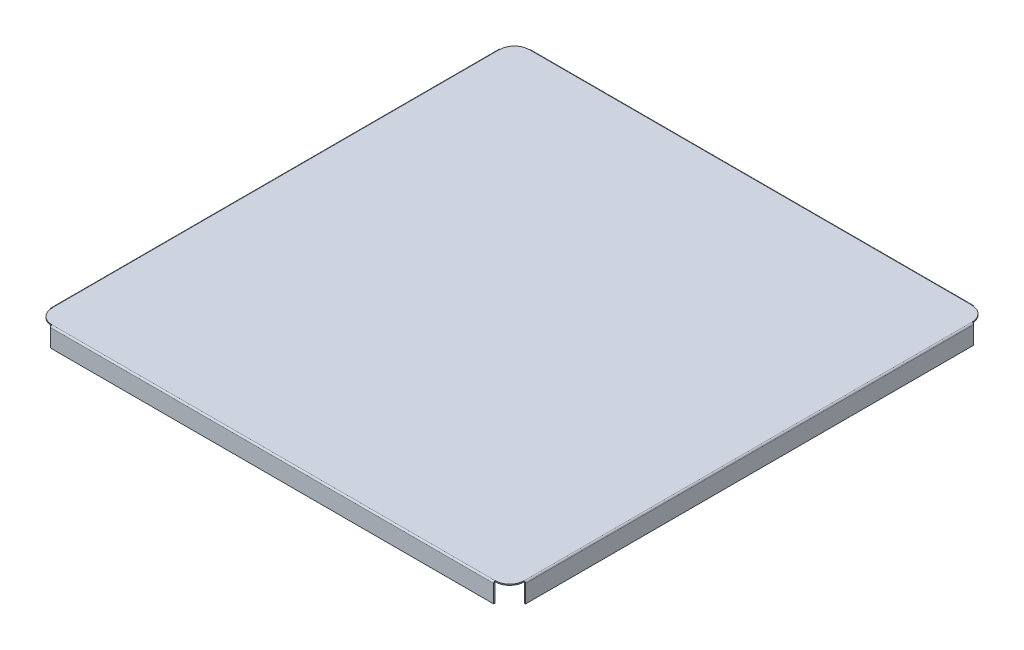
ISO-10303-21;
HEADER;
FILE_DESCRIPTION(('STEP AP214'),'2;1');
FILE_NAME('part.step','',(''),(''),'','','');
FILE_SCHEMA(('AUTOMOTIVE_DESIGN { 1 0 10303 214 1 1 1 1 }'));
ENDSEC;
DATA;
#1=APPLICATION_CONTEXT('core data for automotive mechanical design processes');
#2=APPLICATION_PROTOCOL_DEFINITION('international standard','automotive_design',2000,#1);
#3=PRODUCT_CONTEXT('',#1,'mechanical');
#4=PRODUCT('Part','Part','',(#3));
#5=PRODUCT_RELATED_PRODUCT_CATEGORY('part','',(#4));
#6=PRODUCT_DEFINITION_FORMATION('','',#4);
#7=PRODUCT_DEFINITION_CONTEXT('part definition',#1,'design');
#8=PRODUCT_DEFINITION('design','',#6,#7);
#9=PRODUCT_DEFINITION_SHAPE('','',#8);
#10=(LENGTH_UNIT() NAMED_UNIT(*) SI_UNIT(.MILLI.,.METRE.));
#11=(NAMED_UNIT(*) PLANE_ANGLE_UNIT() SI_UNIT($,.RADIAN.));
#12=(NAMED_UNIT(*) SI_UNIT($,.STERADIAN.) SOLID_ANGLE_UNIT());
#13=UNCERTAINTY_MEASURE_WITH_UNIT(LENGTH_MEASURE(1.E-05),#10,'distance_accuracy_value','');
#14=(GEOMETRIC_REPRESENTATION_CONTEXT(3) GLOBAL_UNCERTAINTY_ASSIGNED_CONTEXT((#13)) GLOBAL_UNIT_ASSIGNED_CONTEXT((#10,
#11,#12)) REPRESENTATION_CONTEXT('',''));
#15=CARTESIAN_POINT('',(0.,0.,0.));
#16=DIRECTION('',(0.,0.,1.));
#17=DIRECTION('',(1.,0.,0.));
#18=AXIS2_PLACEMENT_3D('',#15,#16,#17);
#19=CARTESIAN_POINT('',(-181.882415,0.035,-183.8189237));
#20=DIRECTION('',(0.,1.,0.));
#21=DIRECTION('',(0.,0.,1.));
#22=AXIS2_PLACEMENT_3D('',#19,#20,#21);
#23=CYLINDRICAL_SURFACE('',#22,11.811);
#24=DIRECTION('',(0.,1.,0.));
#25=VECTOR('',#24,1.);
#26=CARTESIAN_POINT('',(-181.882415,0.035,-195.6299237));
#27=LINE('',#26,#25);
#28=CARTESIAN_POINT('',(-181.882415,-0.854000000000024,-195.6299237));
#29=VERTEX_POINT('',#28);
#30=CARTESIAN_POINT('',(-181.882415,0.035,-195.6299237));
#31=VERTEX_POINT('',#30);
#32=EDGE_CURVE('E129',#29,#31,#27,.T.);
#33=ORIENTED_EDGE('',*,*,#32,.F.);
#34=CARTESIAN_POINT('',(-181.882415,-0.854,-183.8189237));
#35=DIRECTION('',(0.,1.,0.));
#36=DIRECTION('',(0.,0.,1.));
#37=AXIS2_PLACEMENT_3D('',#34,#35,#36);
#38=CIRCLE('',#37,11.811);
#39=CARTESIAN_POINT('',(-193.693415,-0.854000000000023,-183.8189237));
#40=VERTEX_POINT('',#39);
#41=EDGE_CURVE('E254',#29,#40,#38,.T.);
#42=ORIENTED_EDGE('',*,*,#41,.T.);
#43=DIRECTION('',(0.,1.,0.));
#44=VECTOR('',#43,1.);
#45=CARTESIAN_POINT('',(-193.693415,0.035,-183.8189237));
#46=LINE('',#45,#44);
#47=CARTESIAN_POINT('',(-193.693415,0.0349999999999771,-183.8189237));
#48=VERTEX_POINT('',#47);
#49=EDGE_CURVE('E223',#40,#48,#46,.T.);
#50=ORIENTED_EDGE('',*,*,#49,.T.);
#51=CARTESIAN_POINT('',(-181.882415,0.035,-183.8189237));
#52=DIRECTION('',(0.,1.,0.));
#53=DIRECTION('',(0.,0.,1.));
#54=AXIS2_PLACEMENT_3D('',#51,#52,#53);
#55=CIRCLE('',#54,11.811);
#56=EDGE_CURVE('E228',#31,#48,#55,.T.);
#57=ORIENTED_EDGE('',*,*,#56,.F.);
#58=EDGE_LOOP('',(#33,#42,#50,#57));
#59=FACE_BOUND('',#58,.T.);
#60=ADVANCED_FACE('F119',(#59),#23,.T.);
#61=CARTESIAN_POINT('',(-181.882415,0.035,183.8189237));
#62=DIRECTION('',(0.,1.,0.));
#63=DIRECTION('',(0.,0.,1.));
#64=AXIS2_PLACEMENT_3D('',#61,#62,#63);
#65=CYLINDRICAL_SURFACE('',#64,11.811);
#66=DIRECTION('',(0.,1.,0.));
#67=VECTOR('',#66,1.);
#68=CARTESIAN_POINT('',(-193.693415,0.035,183.8189237));
#69=LINE('',#68,#67);
#70=CARTESIAN_POINT('',(-193.693415,-0.854000000000023,183.8189237));
#71=VERTEX_POINT('',#70);
#72=CARTESIAN_POINT('',(-193.693415,0.035,183.8189237));
#73=VERTEX_POINT('',#72);
#74=EDGE_CURVE('E269',#71,#73,#69,.T.);
#75=ORIENTED_EDGE('',*,*,#74,.F.);
#76=CARTESIAN_POINT('',(-181.882415,-0.854,183.8189237));
#77=DIRECTION('',(0.,1.,0.));
#78=DIRECTION('',(0.,0.,1.));
#79=AXIS2_PLACEMENT_3D('',#76,#77,#78);
#80=CIRCLE('',#79,11.811);
#81=CARTESIAN_POINT('',(-181.882415,-0.854,195.6299237));
#82=VERTEX_POINT('',#81);
#83=EDGE_CURVE('E250',#71,#82,#80,.T.);
#84=ORIENTED_EDGE('',*,*,#83,.T.);
#85=DIRECTION('',(0.,1.,0.));
#86=VECTOR('',#85,1.);
#87=CARTESIAN_POINT('',(-181.882415,0.035,195.6299237));
#88=LINE('',#87,#86);
#89=CARTESIAN_POINT('',(-181.882415,0.0349999999999786,195.6299237));
#90=VERTEX_POINT('',#89);
#91=EDGE_CURVE('E266',#82,#90,#88,.T.);
#92=ORIENTED_EDGE('',*,*,#91,.T.);
#93=CARTESIAN_POINT('',(-181.882415,0.035,183.8189237));
#94=DIRECTION('',(0.,1.,0.));
#95=DIRECTION('',(0.,0.,1.));
#96=AXIS2_PLACEMENT_3D('',#93,#94,#95);
#97=CIRCLE('',#96,11.811);
#98=EDGE_CURVE('E233',#73,#90,#97,.T.);
#99=ORIENTED_EDGE('',*,*,#98,.F.);
#100=EDGE_LOOP('',(#75,#84,#92,#99));
#101=FACE_BOUND('',#100,.T.);
#102=ADVANCED_FACE('F283',(#101),#65,.T.);
#103=CARTESIAN_POINT('',(181.882415,0.035,183.8189237));
#104=DIRECTION('',(0.,1.,0.));
#105=DIRECTION('',(0.,0.,1.));
#106=AXIS2_PLACEMENT_3D('',#103,#104,#105);
#107=CYLINDRICAL_SURFACE('',#106,11.811);
#108=DIRECTION('',(0.,1.,0.));
#109=VECTOR('',#108,1.);
#110=CARTESIAN_POINT('',(181.882415,0.035,195.6299237));
#111=LINE('',#110,#109);
#112=CARTESIAN_POINT('',(181.882415,-0.854,195.6299237));
#113=VERTEX_POINT('',#112);
#114=CARTESIAN_POINT('',(181.882415,0.035,195.6299237));
#115=VERTEX_POINT('',#114);
#116=EDGE_CURVE('E263',#113,#115,#111,.T.);
#117=ORIENTED_EDGE('',*,*,#116,.F.);
#118=CARTESIAN_POINT('',(181.882415,-0.854,183.8189237));
#119=DIRECTION('',(0.,1.,0.));
#120=DIRECTION('',(0.,0.,1.));
#121=AXIS2_PLACEMENT_3D('',#118,#119,#120);
#122=CIRCLE('',#121,11.811);
#123=CARTESIAN_POINT('',(193.693415,-0.854,183.8189237));
#124=VERTEX_POINT('',#123);
#125=EDGE_CURVE('E245',#113,#124,#122,.T.);
#126=ORIENTED_EDGE('',*,*,#125,.T.);
#127=DIRECTION('',(0.,1.,0.));
#128=VECTOR('',#127,1.);
#129=CARTESIAN_POINT('',(193.693415,0.035,183.8189237));
#130=LINE('',#129,#128);
#131=CARTESIAN_POINT('',(193.693415,0.0350000000000435,183.8189237));
#132=VERTEX_POINT('',#131);
#133=EDGE_CURVE('E260',#124,#132,#130,.T.);
#134=ORIENTED_EDGE('',*,*,#133,.T.);
#135=CARTESIAN_POINT('',(181.882415,0.035,183.8189237));
#136=DIRECTION('',(0.,1.,0.));
#137=DIRECTION('',(0.,0.,1.));
#138=AXIS2_PLACEMENT_3D('',#135,#136,#137);
#139=CIRCLE('',#138,11.811);
#140=EDGE_CURVE('E239',#115,#132,#139,.T.);
#141=ORIENTED_EDGE('',*,*,#140,.F.);
#142=EDGE_LOOP('',(#117,#126,#134,#141));
#143=FACE_BOUND('',#142,.T.);
#144=ADVANCED_FACE('F501',(#143),#107,.T.);
#145=CARTESIAN_POINT('',(181.882415,0.035,-183.8189237));
#146=DIRECTION('',(0.,1.,0.));
#147=DIRECTION('',(0.,0.,1.));
#148=AXIS2_PLACEMENT_3D('',#145,#146,#147);
#149=CYLINDRICAL_SURFACE('',#148,11.811);
#150=CARTESIAN_POINT('',(181.882415,-0.854,-183.8189237));
#151=DIRECTION('',(0.,1.,0.));
#152=DIRECTION('',(0.,0.,1.));
#153=AXIS2_PLACEMENT_3D('',#150,#151,#152);
#154=CIRCLE('',#153,11.811);
#155=CARTESIAN_POINT('',(193.693415,-0.854,-183.8189237));
#156=VERTEX_POINT('',#155);
#157=CARTESIAN_POINT('',(181.882415,-0.854000000000024,-195.6299237));
#158=VERTEX_POINT('',#157);
#159=EDGE_CURVE('E243',#156,#158,#154,.T.);
#160=ORIENTED_EDGE('',*,*,#159,.T.);
#161=DIRECTION('',(0.,1.,0.));
#162=VECTOR('',#161,1.);
#163=CARTESIAN_POINT('',(181.882415,0.035,-195.6299237));
#164=LINE('',#163,#162);
#165=CARTESIAN_POINT('',(181.882415,0.034999999999976,-195.6299237));
#166=VERTEX_POINT('',#165);
#167=EDGE_CURVE('E13',#158,#166,#164,.T.);
#168=ORIENTED_EDGE('',*,*,#167,.T.);
#169=CARTESIAN_POINT('',(181.882415,0.035,-183.8189237));
#170=DIRECTION('',(0.,1.,0.));
#171=DIRECTION('',(0.,0.,1.));
#172=AXIS2_PLACEMENT_3D('',#169,#170,#171);
#173=CIRCLE('',#172,11.811);
#174=CARTESIAN_POINT('',(193.693415,0.035,-183.8189237));
#175=VERTEX_POINT('',#174);
#176=EDGE_CURVE('E229',#175,#166,#173,.T.);
#177=ORIENTED_EDGE('',*,*,#176,.F.);
#178=DIRECTION('',(0.,1.,0.));
#179=VECTOR('',#178,1.);
#180=CARTESIAN_POINT('',(193.693415,0.035,-183.8189237));
#181=LINE('',#180,#179);
#182=EDGE_CURVE('E123',#156,#175,#181,.T.);
#183=ORIENTED_EDGE('',*,*,#182,.F.);
#184=EDGE_LOOP('',(#160,#168,#177,#183));
#185=FACE_BOUND('',#184,.T.);
#186=ADVANCED_FACE('F121',(#185),#149,.T.);
#187=CARTESIAN_POINT('',(0.,0.035,0.));
#188=DIRECTION('',(0.,1.,0.));
#189=DIRECTION('',(0.,0.,1.));
#190=AXIS2_PLACEMENT_3D('',#187,#188,#189);
#191=PLANE('',#190);
#192=DIRECTION('',(0.,0.,1.));
#193=VECTOR('',#192,1.);
#194=CARTESIAN_POINT('',(193.693415,0.035,-195.6299237));
#195=LINE('',#194,#193);
#196=EDGE_CURVE('E248',#175,#132,#195,.T.);
#197=ORIENTED_EDGE('',*,*,#196,.F.);
#198=ORIENTED_EDGE('',*,*,#176,.T.);
#199=DIRECTION('',(-1.,0.,0.));
#200=VECTOR('',#199,1.);
#201=CARTESIAN_POINT('',(193.693415,0.035,-195.6299237));
#202=LINE('',#201,#200);
#203=EDGE_CURVE('E202',#166,#31,#202,.T.);
#204=ORIENTED_EDGE('',*,*,#203,.T.);
#205=ORIENTED_EDGE('',*,*,#56,.T.);
#206=DIRECTION('',(0.,0.,1.));
#207=VECTOR('',#206,1.);
#208=CARTESIAN_POINT('',(-193.693415,0.035,-195.6299237));
#209=LINE('',#208,#207);
#210=EDGE_CURVE('E171',#48,#73,#209,.T.);
#211=ORIENTED_EDGE('',*,*,#210,.T.);
#212=ORIENTED_EDGE('',*,*,#98,.T.);
#213=DIRECTION('',(-1.,0.,0.));
#214=VECTOR('',#213,1.);
#215=CARTESIAN_POINT('',(193.693415,0.035,195.6299237));
#216=LINE('',#215,#214);
#217=EDGE_CURVE('E137',#115,#90,#216,.T.);
#218=ORIENTED_EDGE('',*,*,#217,.F.);
#219=ORIENTED_EDGE('',*,*,#140,.T.);
#220=EDGE_LOOP('',(#197,#198,#204,#205,#211,#212,#218,#219));
#221=FACE_BOUND('',#220,.T.);
#222=ADVANCED_FACE('F227',(#221),#191,.T.);
#223=CARTESIAN_POINT('',(0.,-0.854,0.));
#224=DIRECTION('',(0.,1.,0.));
#225=DIRECTION('',(0.,0.,1.));
#226=AXIS2_PLACEMENT_3D('',#223,#224,#225);
#227=PLANE('',#226);
#228=DIRECTION('',(0.,0.,1.));
#229=VECTOR('',#228,1.);
#230=CARTESIAN_POINT('',(193.693415,-0.854,0.));
#231=LINE('',#230,#229);
#232=EDGE_CURVE('E241',#156,#124,#231,.T.);
#233=ORIENTED_EDGE('',*,*,#232,.T.);
#234=ORIENTED_EDGE('',*,*,#125,.F.);
#235=DIRECTION('',(1.,0.,0.));
#236=VECTOR('',#235,1.);
#237=CARTESIAN_POINT('',(0.,-0.854,195.6299237));
#238=LINE('',#237,#236);
#239=EDGE_CURVE('E156',#113,#82,#238,.F.);
#240=ORIENTED_EDGE('',*,*,#239,.T.);
#241=ORIENTED_EDGE('',*,*,#83,.F.);
#242=DIRECTION('',(0.,0.,1.));
#243=VECTOR('',#242,1.);
#244=CARTESIAN_POINT('',(-193.693415,-0.854,0.));
#245=LINE('',#244,#243);
#246=EDGE_CURVE('E252',#40,#71,#245,.T.);
#247=ORIENTED_EDGE('',*,*,#246,.F.);
#248=ORIENTED_EDGE('',*,*,#41,.F.);
#249=DIRECTION('',(1.,0.,0.));
#250=VECTOR('',#249,1.);
#251=CARTESIAN_POINT('',(0.,-0.854,-195.6299237));
#252=LINE('',#251,#250);
#253=EDGE_CURVE('E256',#158,#29,#252,.F.);
#254=ORIENTED_EDGE('',*,*,#253,.F.);
#255=ORIENTED_EDGE('',*,*,#159,.F.);
#256=EDGE_LOOP('',(#233,#234,#240,#241,#247,#248,#254,#255));
#257=FACE_BOUND('',#256,.T.);
#258=ADVANCED_FACE('F507',(#257),#227,.F.);
#259=CARTESIAN_POINT('',(-193.693415,-1.23499999999999,183.8189237));
#260=DIRECTION('',(0.,0.,1.));
#261=DIRECTION('',(1.,0.,0.));
#262=AXIS2_PLACEMENT_3D('',#259,#260,#261);
#263=PLANE('',#262);
#264=DIRECTION('',(-1.,0.,0.));
#265=VECTOR('',#264,1.);
#266=CARTESIAN_POINT('',(-194.963415,-1.23499999999998,183.8189237));
#267=LINE('',#266,#265);
#268=CARTESIAN_POINT('',(-194.074415,-1.23499999999999,183.8189237));
#269=VERTEX_POINT('',#268);
#270=CARTESIAN_POINT('',(-194.963415,-1.23499999999998,183.8189237));
#271=VERTEX_POINT('',#270);
#272=EDGE_CURVE('E308',#269,#271,#267,.T.);
#273=ORIENTED_EDGE('',*,*,#272,.F.);
#274=CARTESIAN_POINT('',(-193.693415,-1.23499999999999,183.8189237));
#275=DIRECTION('',(0.,0.,-1.));
#276=DIRECTION('',(-1.,0.,0.));
#277=AXIS2_PLACEMENT_3D('',#274,#275,#276);
#278=CIRCLE('',#277,0.380999999999965);
#279=EDGE_CURVE('E279',#71,#269,#278,.F.);
#280=ORIENTED_EDGE('',*,*,#279,.F.);
#281=ORIENTED_EDGE('',*,*,#74,.T.);
#282=CARTESIAN_POINT('',(-193.693415,-1.23499999999999,183.8189237));
#283=DIRECTION('',(0.,0.,-1.));
#284=DIRECTION('',(-1.,0.,0.));
#285=AXIS2_PLACEMENT_3D('',#282,#283,#284);
#286=CIRCLE('',#285,1.26999999999996);
#287=EDGE_CURVE('E244',#73,#271,#286,.F.);
#288=ORIENTED_EDGE('',*,*,#287,.T.);
#289=EDGE_LOOP('',(#273,#280,#281,#288));
#290=FACE_BOUND('',#289,.T.);
#291=ADVANCED_FACE('F276',(#290),#263,.T.);
#292=CARTESIAN_POINT('',(-193.693415,-1.23499999999999,-183.8189237));
#293=DIRECTION('',(0.,0.,1.));
#294=DIRECTION('',(1.,0.,0.));
#295=AXIS2_PLACEMENT_3D('',#292,#293,#294);
#296=PLANE('',#295);
#297=CARTESIAN_POINT('',(-193.693415,-1.23499999999999,-183.8189237));
#298=DIRECTION('',(0.,0.,-1.));
#299=DIRECTION('',(-1.,0.,0.));
#300=AXIS2_PLACEMENT_3D('',#297,#298,#299);
#301=CIRCLE('',#300,0.380999999999965);
#302=CARTESIAN_POINT('',(-194.074415,-1.23499999999999,-183.8189237));
#303=VERTEX_POINT('',#302);
#304=EDGE_CURVE('E320',#303,#40,#301,.T.);
#305=ORIENTED_EDGE('',*,*,#304,.F.);
#306=DIRECTION('',(-1.,0.,0.));
#307=VECTOR('',#306,1.);
#308=CARTESIAN_POINT('',(-194.074415,-1.23499999999999,-183.8189237));
#309=LINE('',#308,#307);
#310=CARTESIAN_POINT('',(-194.963415,-1.23499999999998,-183.8189237));
#311=VERTEX_POINT('',#310);
#312=EDGE_CURVE('E345',#303,#311,#309,.T.);
#313=ORIENTED_EDGE('',*,*,#312,.T.);
#314=CARTESIAN_POINT('',(-193.693415,-1.23499999999999,-183.8189237));
#315=DIRECTION('',(0.,0.,-1.));
#316=DIRECTION('',(-1.,0.,0.));
#317=AXIS2_PLACEMENT_3D('',#314,#315,#316);
#318=CIRCLE('',#317,1.26999999999996);
#319=EDGE_CURVE('E352',#311,#48,#318,.T.);
#320=ORIENTED_EDGE('',*,*,#319,.T.);
#321=ORIENTED_EDGE('',*,*,#49,.F.);
#322=EDGE_LOOP('',(#305,#313,#320,#321));
#323=FACE_BOUND('',#322,.T.);
#324=ADVANCED_FACE('F482',(#323),#296,.F.);
#325=CARTESIAN_POINT('',(-193.693415,-1.23499999999999,-183.8189237));
#326=DIRECTION('',(0.,0.,-1.));
#327=DIRECTION('',(-1.,0.,0.));
#328=AXIS2_PLACEMENT_3D('',#325,#326,#327);
#329=CYLINDRICAL_SURFACE('',#328,1.26999999999996);
#330=ORIENTED_EDGE('',*,*,#210,.F.);
#331=ORIENTED_EDGE('',*,*,#319,.F.);
#332=DIRECTION('',(0.,0.,-1.));
#333=VECTOR('',#332,1.);
#334=CARTESIAN_POINT('',(-194.963415,-1.23499999999998,0.));
#335=LINE('',#334,#333);
#336=EDGE_CURVE('E342',#271,#311,#335,.T.);
#337=ORIENTED_EDGE('',*,*,#336,.F.);
#338=ORIENTED_EDGE('',*,*,#287,.F.);
#339=EDGE_LOOP('',(#330,#331,#337,#338));
#340=FACE_BOUND('',#339,.T.);
#341=ADVANCED_FACE('F485',(#340),#329,.T.);
#342=CARTESIAN_POINT('',(-193.693415,-1.23499999999999,-183.8189237));
#343=DIRECTION('',(0.,0.,-1.));
#344=DIRECTION('',(-1.,0.,0.));
#345=AXIS2_PLACEMENT_3D('',#342,#343,#344);
#346=CYLINDRICAL_SURFACE('',#345,0.380999999999965);
#347=ORIENTED_EDGE('',*,*,#246,.T.);
#348=ORIENTED_EDGE('',*,*,#279,.T.);
#349=DIRECTION('',(0.,0.,1.));
#350=VECTOR('',#349,1.);
#351=CARTESIAN_POINT('',(-194.074415,-1.23499999999999,183.8189237));
#352=LINE('',#351,#350);
#353=EDGE_CURVE('E348',#269,#303,#352,.F.);
#354=ORIENTED_EDGE('',*,*,#353,.T.);
#355=ORIENTED_EDGE('',*,*,#304,.T.);
#356=EDGE_LOOP('',(#347,#348,#354,#355));
#357=FACE_BOUND('',#356,.T.);
#358=ADVANCED_FACE('F487',(#357),#346,.F.);
#359=CARTESIAN_POINT('',(-194.963415,-0.853999999999997,-183.8189237));
#360=DIRECTION('',(0.,0.,-1.));
#361=DIRECTION('',(-1.,0.,0.));
#362=AXIS2_PLACEMENT_3D('',#359,#360,#361);
#363=PLANE('',#362);
#364=DIRECTION('',(0.,1.,0.));
#365=VECTOR('',#364,1.);
#366=CARTESIAN_POINT('',(-194.963415,-0.853999999999997,-183.8189237));
#367=LINE('',#366,#365);
#368=CARTESIAN_POINT('',(-194.963415,-15.854,-183.8189237));
#369=VERTEX_POINT('',#368);
#370=EDGE_CURVE('E324',#369,#311,#367,.T.);
#371=ORIENTED_EDGE('',*,*,#370,.T.);
#372=ORIENTED_EDGE('',*,*,#312,.F.);
#373=DIRECTION('',(0.,-1.,0.));
#374=VECTOR('',#373,1.);
#375=CARTESIAN_POINT('',(-194.074415,7.16809630170919E-13,-183.8189237));
#376=LINE('',#375,#374);
#377=CARTESIAN_POINT('',(-194.074415,-15.854,-183.8189237));
#378=VERTEX_POINT('',#377);
#379=EDGE_CURVE('E333',#378,#303,#376,.F.);
#380=ORIENTED_EDGE('',*,*,#379,.F.);
#381=DIRECTION('',(1.,0.,0.));
#382=VECTOR('',#381,1.);
#383=CARTESIAN_POINT('',(-194.963415,-15.854,-183.8189237));
#384=LINE('',#383,#382);
#385=EDGE_CURVE('E317',#369,#378,#384,.T.);
#386=ORIENTED_EDGE('',*,*,#385,.F.);
#387=EDGE_LOOP('',(#371,#372,#380,#386));
#388=FACE_BOUND('',#387,.T.);
#389=ADVANCED_FACE('F478',(#388),#363,.T.);
#390=CARTESIAN_POINT('',(-194.963415,-15.854,183.8189237));
#391=DIRECTION('',(0.,0.,1.));
#392=DIRECTION('',(1.,0.,0.));
#393=AXIS2_PLACEMENT_3D('',#390,#391,#392);
#394=PLANE('',#393);
#395=DIRECTION('',(0.,1.,0.));
#396=VECTOR('',#395,1.);
#397=CARTESIAN_POINT('',(-194.074415,7.16809630170919E-13,183.8189237));
#398=LINE('',#397,#396);
#399=CARTESIAN_POINT('',(-194.074415,-15.854,183.8189237));
#400=VERTEX_POINT('',#399);
#401=EDGE_CURVE('E339',#269,#400,#398,.F.);
#402=ORIENTED_EDGE('',*,*,#401,.F.);
#403=ORIENTED_EDGE('',*,*,#272,.T.);
#404=DIRECTION('',(0.,-1.,0.));
#405=VECTOR('',#404,1.);
#406=CARTESIAN_POINT('',(-194.963415,-15.854,183.8189237));
#407=LINE('',#406,#405);
#408=CARTESIAN_POINT('',(-194.963415,-15.854,183.8189237));
#409=VERTEX_POINT('',#408);
#410=EDGE_CURVE('E330',#271,#409,#407,.T.);
#411=ORIENTED_EDGE('',*,*,#410,.T.);
#412=DIRECTION('',(1.,0.,0.));
#413=VECTOR('',#412,1.);
#414=CARTESIAN_POINT('',(-194.963415,-15.854,183.8189237));
#415=LINE('',#414,#413);
#416=EDGE_CURVE('E321',#409,#400,#415,.T.);
#417=ORIENTED_EDGE('',*,*,#416,.T.);
#418=EDGE_LOOP('',(#402,#403,#411,#417));
#419=FACE_BOUND('',#418,.T.);
#420=ADVANCED_FACE('F471',(#419),#394,.T.);
#421=CARTESIAN_POINT('',(-194.963415,7.1991355708115E-13,0.));
#422=DIRECTION('',(-1.,0.,0.));
#423=DIRECTION('',(0.,-1.,0.));
#424=AXIS2_PLACEMENT_3D('',#421,#422,#423);
#425=PLANE('',#424);
#426=ORIENTED_EDGE('',*,*,#410,.F.);
#427=ORIENTED_EDGE('',*,*,#336,.T.);
#428=ORIENTED_EDGE('',*,*,#370,.F.);
#429=DIRECTION('',(0.,0.,-1.));
#430=VECTOR('',#429,1.);
#431=CARTESIAN_POINT('',(-194.963415,-15.854,-183.8189237));
#432=LINE('',#431,#430);
#433=EDGE_CURVE('E327',#409,#369,#432,.T.);
#434=ORIENTED_EDGE('',*,*,#433,.F.);
#435=EDGE_LOOP('',(#426,#427,#428,#434));
#436=FACE_BOUND('',#435,.T.);
#437=ADVANCED_FACE('F484',(#436),#425,.T.);
#438=CARTESIAN_POINT('',(-194.074415,7.16809630170919E-13,0.));
#439=DIRECTION('',(-1.,0.,0.));
#440=DIRECTION('',(0.,-1.,0.));
#441=AXIS2_PLACEMENT_3D('',#438,#439,#440);
#442=PLANE('',#441);
#443=ORIENTED_EDGE('',*,*,#353,.F.);
#444=ORIENTED_EDGE('',*,*,#401,.T.);
#445=DIRECTION('',(0.,0.,1.));
#446=VECTOR('',#445,1.);
#447=CARTESIAN_POINT('',(-194.074415,-15.854,0.));
#448=LINE('',#447,#446);
#449=EDGE_CURVE('E336',#400,#378,#448,.F.);
#450=ORIENTED_EDGE('',*,*,#449,.T.);
#451=ORIENTED_EDGE('',*,*,#379,.T.);
#452=EDGE_LOOP('',(#443,#444,#450,#451));
#453=FACE_BOUND('',#452,.T.);
#454=ADVANCED_FACE('F466',(#453),#442,.F.);
#455=CARTESIAN_POINT('',(-194.963415,-15.854,-183.8189237));
#456=DIRECTION('',(0.,-1.,0.));
#457=DIRECTION('',(1.,0.,0.));
#458=AXIS2_PLACEMENT_3D('',#455,#456,#457);
#459=PLANE('',#458);
#460=ORIENTED_EDGE('',*,*,#449,.F.);
#461=ORIENTED_EDGE('',*,*,#416,.F.);
#462=ORIENTED_EDGE('',*,*,#433,.T.);
#463=ORIENTED_EDGE('',*,*,#385,.T.);
#464=EDGE_LOOP('',(#460,#461,#462,#463));
#465=FACE_BOUND('',#464,.T.);
#466=ADVANCED_FACE('F475',(#465),#459,.T.);
#467=CARTESIAN_POINT('',(181.882415,-1.23499999999999,195.6299237));
#468=DIRECTION('',(1.,0.,0.));
#469=DIRECTION('',(0.,0.,-1.));
#470=AXIS2_PLACEMENT_3D('',#467,#468,#469);
#471=PLANE('',#470);
#472=DIRECTION('',(0.,0.,1.));
#473=VECTOR('',#472,1.);
#474=CARTESIAN_POINT('',(181.882415,-1.23499999999999,196.8999237));
#475=LINE('',#474,#473);
#476=CARTESIAN_POINT('',(181.882415,-1.23499999999998,196.0109237));
#477=VERTEX_POINT('',#476);
#478=CARTESIAN_POINT('',(181.882415,-1.23499999999998,196.8999237));
#479=VERTEX_POINT('',#478);
#480=EDGE_CURVE('E382',#477,#479,#475,.T.);
#481=ORIENTED_EDGE('',*,*,#480,.F.);
#482=CARTESIAN_POINT('',(181.882415,-1.23499999999999,195.6299237));
#483=DIRECTION('',(-1.,0.,0.));
#484=DIRECTION('',(0.,0.,1.));
#485=AXIS2_PLACEMENT_3D('',#482,#483,#484);
#486=CIRCLE('',#485,0.380999999999965);
#487=EDGE_CURVE('E306',#113,#477,#486,.F.);
#488=ORIENTED_EDGE('',*,*,#487,.F.);
#489=ORIENTED_EDGE('',*,*,#116,.T.);
#490=CARTESIAN_POINT('',(181.882415,-1.23499999999999,195.6299237));
#491=DIRECTION('',(-1.,0.,0.));
#492=DIRECTION('',(0.,0.,1.));
#493=AXIS2_PLACEMENT_3D('',#490,#491,#492);
#494=CIRCLE('',#493,1.26999999999996);
#495=EDGE_CURVE('E301',#115,#479,#494,.F.);
#496=ORIENTED_EDGE('',*,*,#495,.T.);
#497=EDGE_LOOP('',(#481,#488,#489,#496));
#498=FACE_BOUND('',#497,.T.);
#499=ADVANCED_FACE('F578',(#498),#471,.T.);
#500=CARTESIAN_POINT('',(-181.882415,-1.23499999999999,195.6299237));
#501=DIRECTION('',(1.,0.,0.));
#502=DIRECTION('',(0.,0.,-1.));
#503=AXIS2_PLACEMENT_3D('',#500,#501,#502);
#504=PLANE('',#503);
#505=CARTESIAN_POINT('',(-181.882415,-1.23499999999999,195.6299237));
#506=DIRECTION('',(-1.,0.,0.));
#507=DIRECTION('',(0.,0.,1.));
#508=AXIS2_PLACEMENT_3D('',#505,#506,#507);
#509=CIRCLE('',#508,0.380999999999965);
#510=CARTESIAN_POINT('',(-181.882415,-1.23499999999998,196.0109237));
#511=VERTEX_POINT('',#510);
#512=EDGE_CURVE('E311',#511,#82,#509,.T.);
#513=ORIENTED_EDGE('',*,*,#512,.F.);
#514=DIRECTION('',(0.,0.,1.));
#515=VECTOR('',#514,1.);
#516=CARTESIAN_POINT('',(-181.882415,-1.23499999999999,196.0109237));
#517=LINE('',#516,#515);
#518=CARTESIAN_POINT('',(-181.882415,-1.23499999999999,196.8999237));
#519=VERTEX_POINT('',#518);
#520=EDGE_CURVE('E304',#511,#519,#517,.T.);
#521=ORIENTED_EDGE('',*,*,#520,.T.);
#522=CARTESIAN_POINT('',(-181.882415,-1.23499999999999,195.6299237));
#523=DIRECTION('',(-1.,0.,0.));
#524=DIRECTION('',(0.,0.,1.));
#525=AXIS2_PLACEMENT_3D('',#522,#523,#524);
#526=CIRCLE('',#525,1.26999999999996);
#527=EDGE_CURVE('E298',#519,#90,#526,.T.);
#528=ORIENTED_EDGE('',*,*,#527,.T.);
#529=ORIENTED_EDGE('',*,*,#91,.F.);
#530=EDGE_LOOP('',(#513,#521,#528,#529));
#531=FACE_BOUND('',#530,.T.);
#532=ADVANCED_FACE('F302',(#531),#504,.F.);
#533=CARTESIAN_POINT('',(-181.882415,-1.23499999999999,195.6299237));
#534=DIRECTION('',(-1.,0.,0.));
#535=DIRECTION('',(0.,0.,1.));
#536=AXIS2_PLACEMENT_3D('',#533,#534,#535);
#537=CYLINDRICAL_SURFACE('',#536,1.26999999999996);
#538=ORIENTED_EDGE('',*,*,#217,.T.);
#539=ORIENTED_EDGE('',*,*,#527,.F.);
#540=DIRECTION('',(-1.,0.,0.));
#541=VECTOR('',#540,1.);
#542=CARTESIAN_POINT('',(181.882415,-1.23499999999999,196.8999237));
#543=LINE('',#542,#541);
#544=EDGE_CURVE('E414',#519,#479,#543,.F.);
#545=ORIENTED_EDGE('',*,*,#544,.T.);
#546=ORIENTED_EDGE('',*,*,#495,.F.);
#547=EDGE_LOOP('',(#538,#539,#545,#546));
#548=FACE_BOUND('',#547,.T.);
#549=ADVANCED_FACE('F295',(#548),#537,.T.);
#550=CARTESIAN_POINT('',(-181.882415,-1.23499999999999,195.6299237));
#551=DIRECTION('',(-1.,0.,0.));
#552=DIRECTION('',(0.,0.,1.));
#553=AXIS2_PLACEMENT_3D('',#550,#551,#552);
#554=CYLINDRICAL_SURFACE('',#553,0.380999999999965);
#555=ORIENTED_EDGE('',*,*,#239,.F.);
#556=ORIENTED_EDGE('',*,*,#487,.T.);
#557=DIRECTION('',(-1.,0.,0.));
#558=VECTOR('',#557,1.);
#559=CARTESIAN_POINT('',(181.882415,-1.23499999999999,196.0109237));
#560=LINE('',#559,#558);
#561=EDGE_CURVE('E417',#477,#511,#560,.T.);
#562=ORIENTED_EDGE('',*,*,#561,.T.);
#563=ORIENTED_EDGE('',*,*,#512,.T.);
#564=EDGE_LOOP('',(#555,#556,#562,#563));
#565=FACE_BOUND('',#564,.T.);
#566=ADVANCED_FACE('F606',(#565),#554,.F.);
#567=CARTESIAN_POINT('',(181.882415,-0.853999999999997,196.8999237));
#568=DIRECTION('',(1.,0.,0.));
#569=DIRECTION('',(0.,0.,-1.));
#570=AXIS2_PLACEMENT_3D('',#567,#568,#569);
#571=PLANE('',#570);
#572=DIRECTION('',(0.,-1.,0.));
#573=VECTOR('',#572,1.);
#574=CARTESIAN_POINT('',(181.882415,7.23976151991342E-13,196.0109237));
#575=LINE('',#574,#573);
#576=CARTESIAN_POINT('',(181.882415,-15.854,196.0109237));
#577=VERTEX_POINT('',#576);
#578=EDGE_CURVE('E411',#477,#577,#575,.T.);
#579=ORIENTED_EDGE('',*,*,#578,.F.);
#580=ORIENTED_EDGE('',*,*,#480,.T.);
#581=DIRECTION('',(0.,1.,0.));
#582=VECTOR('',#581,1.);
#583=CARTESIAN_POINT('',(181.882415,-0.853999999999997,196.8999237));
#584=LINE('',#583,#582);
#585=CARTESIAN_POINT('',(181.882415,-15.854,196.8999237));
#586=VERTEX_POINT('',#585);
#587=EDGE_CURVE('E402',#479,#586,#584,.F.);
#588=ORIENTED_EDGE('',*,*,#587,.T.);
#589=DIRECTION('',(0.,0.,-1.));
#590=VECTOR('',#589,1.);
#591=CARTESIAN_POINT('',(181.882415,-15.854,196.8999237));
#592=LINE('',#591,#590);
#593=EDGE_CURVE('E393',#586,#577,#592,.T.);
#594=ORIENTED_EDGE('',*,*,#593,.T.);
#595=EDGE_LOOP('',(#579,#580,#588,#594));
#596=FACE_BOUND('',#595,.T.);
#597=ADVANCED_FACE('F424',(#596),#571,.T.);
#598=CARTESIAN_POINT('',(-181.882415,-15.854,196.8999237));
#599=DIRECTION('',(-1.,0.,0.));
#600=DIRECTION('',(0.,0.,1.));
#601=AXIS2_PLACEMENT_3D('',#598,#599,#600);
#602=PLANE('',#601);
#603=DIRECTION('',(0.,-1.,0.));
#604=VECTOR('',#603,1.);
#605=CARTESIAN_POINT('',(-181.882415,-15.854,196.8999237));
#606=LINE('',#605,#604);
#607=CARTESIAN_POINT('',(-181.882415,-15.854,196.8999237));
#608=VERTEX_POINT('',#607);
#609=EDGE_CURVE('E396',#608,#519,#606,.F.);
#610=ORIENTED_EDGE('',*,*,#609,.T.);
#611=ORIENTED_EDGE('',*,*,#520,.F.);
#612=DIRECTION('',(0.,1.,0.));
#613=VECTOR('',#612,1.);
#614=CARTESIAN_POINT('',(-181.882415,7.23976151991342E-13,196.0109237));
#615=LINE('',#614,#613);
#616=CARTESIAN_POINT('',(-181.882415,-15.854,196.0109237));
#617=VERTEX_POINT('',#616);
#618=EDGE_CURVE('E405',#617,#511,#615,.T.);
#619=ORIENTED_EDGE('',*,*,#618,.F.);
#620=DIRECTION('',(0.,0.,-1.));
#621=VECTOR('',#620,1.);
#622=CARTESIAN_POINT('',(-181.882415,-15.854,196.8999237));
#623=LINE('',#622,#621);
#624=EDGE_CURVE('E316',#608,#617,#623,.T.);
#625=ORIENTED_EDGE('',*,*,#624,.F.);
#626=EDGE_LOOP('',(#610,#611,#619,#625));
#627=FACE_BOUND('',#626,.T.);
#628=ADVANCED_FACE('F626',(#627),#602,.T.);
#629=CARTESIAN_POINT('',(0.,7.27080078901574E-13,196.8999237));
#630=DIRECTION('',(0.,0.,-1.));
#631=DIRECTION('',(0.,1.,0.));
#632=AXIS2_PLACEMENT_3D('',#629,#630,#631);
#633=PLANE('',#632);
#634=ORIENTED_EDGE('',*,*,#544,.F.);
#635=ORIENTED_EDGE('',*,*,#609,.F.);
#636=DIRECTION('',(1.,0.,0.));
#637=VECTOR('',#636,1.);
#638=CARTESIAN_POINT('',(181.882415,-15.854,196.8999237));
#639=LINE('',#638,#637);
#640=EDGE_CURVE('E399',#586,#608,#639,.F.);
#641=ORIENTED_EDGE('',*,*,#640,.F.);
#642=ORIENTED_EDGE('',*,*,#587,.F.);
#643=EDGE_LOOP('',(#634,#635,#641,#642));
#644=FACE_BOUND('',#643,.T.);
#645=ADVANCED_FACE('F434',(#644),#633,.F.);
#646=CARTESIAN_POINT('',(0.,7.23976151991342E-13,196.0109237));
#647=DIRECTION('',(0.,0.,-1.));
#648=DIRECTION('',(0.,1.,0.));
#649=AXIS2_PLACEMENT_3D('',#646,#647,#648);
#650=PLANE('',#649);
#651=ORIENTED_EDGE('',*,*,#618,.T.);
#652=ORIENTED_EDGE('',*,*,#561,.F.);
#653=ORIENTED_EDGE('',*,*,#578,.T.);
#654=DIRECTION('',(-1.,0.,0.));
#655=VECTOR('',#654,1.);
#656=CARTESIAN_POINT('',(0.,-15.854,196.0109237));
#657=LINE('',#656,#655);
#658=EDGE_CURVE('E408',#577,#617,#657,.T.);
#659=ORIENTED_EDGE('',*,*,#658,.T.);
#660=EDGE_LOOP('',(#651,#652,#653,#659));
#661=FACE_BOUND('',#660,.T.);
#662=ADVANCED_FACE('F645',(#661),#650,.T.);
#663=CARTESIAN_POINT('',(181.882415,-15.854,196.8999237));
#664=DIRECTION('',(0.,-1.,0.));
#665=DIRECTION('',(0.,0.,-1.));
#666=AXIS2_PLACEMENT_3D('',#663,#664,#665);
#667=PLANE('',#666);
#668=ORIENTED_EDGE('',*,*,#658,.F.);
#669=ORIENTED_EDGE('',*,*,#593,.F.);
#670=ORIENTED_EDGE('',*,*,#640,.T.);
#671=ORIENTED_EDGE('',*,*,#624,.T.);
#672=EDGE_LOOP('',(#668,#669,#670,#671));
#673=FACE_BOUND('',#672,.T.);
#674=ADVANCED_FACE('F441',(#673),#667,.T.);
#675=CARTESIAN_POINT('',(193.693415,-1.23500000000003,-183.8189237));
#676=DIRECTION('',(0.,0.,-1.));
#677=DIRECTION('',(0.,1.,0.));
#678=AXIS2_PLACEMENT_3D('',#675,#676,#677);
#679=PLANE('',#678);
#680=DIRECTION('',(1.,0.,0.));
#681=VECTOR('',#680,1.);
#682=CARTESIAN_POINT('',(194.963415,-1.23499999999998,-183.8189237));
#683=LINE('',#682,#681);
#684=CARTESIAN_POINT('',(194.074415,-1.23500000000002,-183.8189237));
#685=VERTEX_POINT('',#684);
#686=CARTESIAN_POINT('',(194.963415,-1.23500000000002,-183.8189237));
#687=VERTEX_POINT('',#686);
#688=EDGE_CURVE('E210',#685,#687,#683,.T.);
#689=ORIENTED_EDGE('',*,*,#688,.F.);
#690=CARTESIAN_POINT('',(193.693415,-1.23500000000003,-183.8189237));
#691=DIRECTION('',(0.,0.,1.));
#692=DIRECTION('',(0.,-1.,0.));
#693=AXIS2_PLACEMENT_3D('',#690,#691,#692);
#694=CIRCLE('',#693,0.380999999999965);
#695=EDGE_CURVE('E380',#156,#685,#694,.F.);
#696=ORIENTED_EDGE('',*,*,#695,.F.);
#697=ORIENTED_EDGE('',*,*,#182,.T.);
#698=CARTESIAN_POINT('',(193.693415,-1.23500000000003,-183.8189237));
#699=DIRECTION('',(0.,0.,1.));
#700=DIRECTION('',(0.,-1.,0.));
#701=AXIS2_PLACEMENT_3D('',#698,#699,#700);
#702=CIRCLE('',#701,1.26999999999996);
#703=EDGE_CURVE('E369',#175,#687,#702,.F.);
#704=ORIENTED_EDGE('',*,*,#703,.T.);
#705=EDGE_LOOP('',(#689,#696,#697,#704));
#706=FACE_BOUND('',#705,.T.);
#707=ADVANCED_FACE('F665',(#706),#679,.T.);
#708=CARTESIAN_POINT('',(193.693415,-1.23499999999992,183.8189237));
#709=DIRECTION('',(0.,0.,-1.));
#710=DIRECTION('',(0.,1.,0.));
#711=AXIS2_PLACEMENT_3D('',#708,#709,#710);
#712=PLANE('',#711);
#713=CARTESIAN_POINT('',(193.693415,-1.23499999999992,183.8189237));
#714=DIRECTION('',(0.,0.,1.));
#715=DIRECTION('',(0.,-1.,0.));
#716=AXIS2_PLACEMENT_3D('',#713,#714,#715);
#717=CIRCLE('',#716,0.380999999999965);
#718=CARTESIAN_POINT('',(194.074415,-1.23499999999992,183.8189237));
#719=VERTEX_POINT('',#718);
#720=EDGE_CURVE('E385',#719,#124,#717,.T.);
#721=ORIENTED_EDGE('',*,*,#720,.F.);
#722=DIRECTION('',(1.,0.,0.));
#723=VECTOR('',#722,1.);
#724=CARTESIAN_POINT('',(194.074415,-1.23499999999996,183.8189237));
#725=LINE('',#724,#723);
#726=CARTESIAN_POINT('',(194.963415,-1.23499999999995,183.8189237));
#727=VERTEX_POINT('',#726);
#728=EDGE_CURVE('E378',#719,#727,#725,.T.);
#729=ORIENTED_EDGE('',*,*,#728,.T.);
#730=CARTESIAN_POINT('',(193.693415,-1.23499999999992,183.8189237));
#731=DIRECTION('',(0.,0.,1.));
#732=DIRECTION('',(0.,-1.,0.));
#733=AXIS2_PLACEMENT_3D('',#730,#731,#732);
#734=CIRCLE('',#733,1.26999999999996);
#735=EDGE_CURVE('E366',#727,#132,#734,.T.);
#736=ORIENTED_EDGE('',*,*,#735,.T.);
#737=ORIENTED_EDGE('',*,*,#133,.F.);
#738=EDGE_LOOP('',(#721,#729,#736,#737));
#739=FACE_BOUND('',#738,.T.);
#740=ADVANCED_FACE('F375',(#739),#712,.F.);
#741=CARTESIAN_POINT('',(193.693415,-1.23499999999992,183.8189237));
#742=DIRECTION('',(0.,0.,1.));
#743=DIRECTION('',(1.,0.,0.));
#744=AXIS2_PLACEMENT_3D('',#741,#742,#743);
#745=CYLINDRICAL_SURFACE('',#744,1.26999999999996);
#746=ORIENTED_EDGE('',*,*,#196,.T.);
#747=ORIENTED_EDGE('',*,*,#735,.F.);
#748=DIRECTION('',(0.,0.,1.));
#749=VECTOR('',#748,1.);
#750=CARTESIAN_POINT('',(194.963415,-1.23499999999998,-183.8189237));
#751=LINE('',#750,#749);
#752=EDGE_CURVE('E975',#727,#687,#751,.F.);
#753=ORIENTED_EDGE('',*,*,#752,.T.);
#754=ORIENTED_EDGE('',*,*,#703,.F.);
#755=EDGE_LOOP('',(#746,#747,#753,#754));
#756=FACE_BOUND('',#755,.T.);
#757=ADVANCED_FACE('F363',(#756),#745,.T.);
#758=CARTESIAN_POINT('',(193.693415,-1.23499999999992,183.8189237));
#759=DIRECTION('',(0.,0.,1.));
#760=DIRECTION('',(1.,0.,0.));
#761=AXIS2_PLACEMENT_3D('',#758,#759,#760);
#762=CYLINDRICAL_SURFACE('',#761,0.380999999999965);
#763=ORIENTED_EDGE('',*,*,#232,.F.);
#764=ORIENTED_EDGE('',*,*,#695,.T.);
#765=DIRECTION('',(0.,0.,1.));
#766=VECTOR('',#765,1.);
#767=CARTESIAN_POINT('',(194.074415,-1.23499999999999,-183.8189237));
#768=LINE('',#767,#766);
#769=EDGE_CURVE('E971',#685,#719,#768,.T.);
#770=ORIENTED_EDGE('',*,*,#769,.T.);
#771=ORIENTED_EDGE('',*,*,#720,.T.);
#772=EDGE_LOOP('',(#763,#764,#770,#771));
#773=FACE_BOUND('',#772,.T.);
#774=ADVANCED_FACE('F694',(#773),#762,.F.);
#775=CARTESIAN_POINT('',(194.963415,-0.853999999999997,-183.8189237));
#776=DIRECTION('',(0.,0.,-1.));
#777=DIRECTION('',(-1.,0.,0.));
#778=AXIS2_PLACEMENT_3D('',#775,#776,#777);
#779=PLANE('',#778);
#780=DIRECTION('',(0.,-1.,0.));
#781=VECTOR('',#780,1.);
#782=CARTESIAN_POINT('',(194.074415,7.16809630170919E-13,-183.8189237));
#783=LINE('',#782,#781);
#784=CARTESIAN_POINT('',(194.074415,-15.854,-183.8189237));
#785=VERTEX_POINT('',#784);
#786=EDGE_CURVE('E977',#685,#785,#783,.T.);
#787=ORIENTED_EDGE('',*,*,#786,.F.);
#788=ORIENTED_EDGE('',*,*,#688,.T.);
#789=DIRECTION('',(0.,1.,0.));
#790=VECTOR('',#789,1.);
#791=CARTESIAN_POINT('',(194.963415,-0.853999999999997,-183.8189237));
#792=LINE('',#791,#790);
#793=CARTESIAN_POINT('',(194.963415,-15.854,-183.8189237));
#794=VERTEX_POINT('',#793);
#795=EDGE_CURVE('E986',#687,#794,#792,.F.);
#796=ORIENTED_EDGE('',*,*,#795,.T.);
#797=DIRECTION('',(-1.,0.,0.));
#798=VECTOR('',#797,1.);
#799=CARTESIAN_POINT('',(194.963415,-15.854,-183.8189237));
#800=LINE('',#799,#798);
#801=EDGE_CURVE('E994',#794,#785,#800,.T.);
#802=ORIENTED_EDGE('',*,*,#801,.T.);
#803=EDGE_LOOP('',(#787,#788,#796,#802));
#804=FACE_BOUND('',#803,.T.);
#805=ADVANCED_FACE('F704',(#804),#779,.T.);
#806=CARTESIAN_POINT('',(194.963415,-15.854,183.8189237));
#807=DIRECTION('',(0.,0.,1.));
#808=DIRECTION('',(1.,0.,0.));
#809=AXIS2_PLACEMENT_3D('',#806,#807,#808);
#810=PLANE('',#809);
#811=DIRECTION('',(0.,-1.,0.));
#812=VECTOR('',#811,1.);
#813=CARTESIAN_POINT('',(194.963415,-15.854,183.8189237));
#814=LINE('',#813,#812);
#815=CARTESIAN_POINT('',(194.963415,-15.854,183.8189237));
#816=VERTEX_POINT('',#815);
#817=EDGE_CURVE('E991',#816,#727,#814,.F.);
#818=ORIENTED_EDGE('',*,*,#817,.T.);
#819=ORIENTED_EDGE('',*,*,#728,.F.);
#820=DIRECTION('',(0.,1.,0.));
#821=VECTOR('',#820,1.);
#822=CARTESIAN_POINT('',(194.074415,7.16809630170919E-13,183.8189237));
#823=LINE('',#822,#821);
#824=CARTESIAN_POINT('',(194.074415,-15.854,183.8189237));
#825=VERTEX_POINT('',#824);
#826=EDGE_CURVE('E983',#825,#719,#823,.T.);
#827=ORIENTED_EDGE('',*,*,#826,.F.);
#828=DIRECTION('',(-1.,0.,0.));
#829=VECTOR('',#828,1.);
#830=CARTESIAN_POINT('',(194.963415,-15.854,183.8189237));
#831=LINE('',#830,#829);
#832=EDGE_CURVE('E390',#816,#825,#831,.T.);
#833=ORIENTED_EDGE('',*,*,#832,.F.);
#834=EDGE_LOOP('',(#818,#819,#827,#833));
#835=FACE_BOUND('',#834,.T.);
#836=ADVANCED_FACE('F715',(#835),#810,.T.);
#837=CARTESIAN_POINT('',(194.963415,7.1991355708115E-13,0.));
#838=DIRECTION('',(-1.,0.,0.));
#839=DIRECTION('',(0.,-1.,0.));
#840=AXIS2_PLACEMENT_3D('',#837,#838,#839);
#841=PLANE('',#840);
#842=ORIENTED_EDGE('',*,*,#752,.F.);
#843=ORIENTED_EDGE('',*,*,#817,.F.);
#844=DIRECTION('',(0.,0.,-1.));
#845=VECTOR('',#844,1.);
#846=CARTESIAN_POINT('',(194.963415,-15.854,-183.8189237));
#847=LINE('',#846,#845);
#848=EDGE_CURVE('E988',#794,#816,#847,.F.);
#849=ORIENTED_EDGE('',*,*,#848,.F.);
#850=ORIENTED_EDGE('',*,*,#795,.F.);
#851=EDGE_LOOP('',(#842,#843,#849,#850));
#852=FACE_BOUND('',#851,.T.);
#853=ADVANCED_FACE('F726',(#852),#841,.F.);
#854=CARTESIAN_POINT('',(194.074415,7.16809630170919E-13,0.));
#855=DIRECTION('',(-1.,0.,0.));
#856=DIRECTION('',(0.,-1.,0.));
#857=AXIS2_PLACEMENT_3D('',#854,#855,#856);
#858=PLANE('',#857);
#859=ORIENTED_EDGE('',*,*,#826,.T.);
#860=ORIENTED_EDGE('',*,*,#769,.F.);
#861=ORIENTED_EDGE('',*,*,#786,.T.);
#862=DIRECTION('',(0.,0.,1.));
#863=VECTOR('',#862,1.);
#864=CARTESIAN_POINT('',(194.074415,-15.854,0.));
#865=LINE('',#864,#863);
#866=EDGE_CURVE('E980',#785,#825,#865,.T.);
#867=ORIENTED_EDGE('',*,*,#866,.T.);
#868=EDGE_LOOP('',(#859,#860,#861,#867));
#869=FACE_BOUND('',#868,.T.);
#870=ADVANCED_FACE('F737',(#869),#858,.T.);
#871=CARTESIAN_POINT('',(194.963415,-15.854,-183.8189237));
#872=DIRECTION('',(0.,-1.,0.));
#873=DIRECTION('',(1.,0.,0.));
#874=AXIS2_PLACEMENT_3D('',#871,#872,#873);
#875=PLANE('',#874);
#876=ORIENTED_EDGE('',*,*,#866,.F.);
#877=ORIENTED_EDGE('',*,*,#801,.F.);
#878=ORIENTED_EDGE('',*,*,#848,.T.);
#879=ORIENTED_EDGE('',*,*,#832,.T.);
#880=EDGE_LOOP('',(#876,#877,#878,#879));
#881=FACE_BOUND('',#880,.T.);
#882=ADVANCED_FACE('F748',(#881),#875,.T.);
#883=CARTESIAN_POINT('',(-181.882415,-1.23499999999999,-195.6299237));
#884=DIRECTION('',(-1.,0.,0.));
#885=DIRECTION('',(0.,0.,1.));
#886=AXIS2_PLACEMENT_3D('',#883,#884,#885);
#887=PLANE('',#886);
#888=DIRECTION('',(0.,0.,-1.));
#889=VECTOR('',#888,1.);
#890=CARTESIAN_POINT('',(-181.882415,-1.23499999999998,-196.8999237));
#891=LINE('',#890,#889);
#892=CARTESIAN_POINT('',(-181.882415,-1.23499999999999,-196.0109237));
#893=VERTEX_POINT('',#892);
#894=CARTESIAN_POINT('',(-181.882415,-1.23499999999998,-196.8999237));
#895=VERTEX_POINT('',#894);
#896=EDGE_CURVE('E1005',#893,#895,#891,.T.);
#897=ORIENTED_EDGE('',*,*,#896,.F.);
#898=CARTESIAN_POINT('',(-181.882415,-1.23499999999999,-195.6299237));
#899=DIRECTION('',(1.,0.,0.));
#900=DIRECTION('',(0.,0.,-1.));
#901=AXIS2_PLACEMENT_3D('',#898,#899,#900);
#902=CIRCLE('',#901,0.380999999999965);
#903=EDGE_CURVE('E218',#29,#893,#902,.F.);
#904=ORIENTED_EDGE('',*,*,#903,.F.);
#905=ORIENTED_EDGE('',*,*,#32,.T.);
#906=CARTESIAN_POINT('',(-181.882415,-1.23499999999999,-195.6299237));
#907=DIRECTION('',(1.,0.,0.));
#908=DIRECTION('',(0.,0.,-1.));
#909=AXIS2_PLACEMENT_3D('',#906,#907,#908);
#910=CIRCLE('',#909,1.26999999999996);
#911=EDGE_CURVE('E196',#31,#895,#910,.F.);
#912=ORIENTED_EDGE('',*,*,#911,.T.);
#913=EDGE_LOOP('',(#897,#904,#905,#912));
#914=FACE_BOUND('',#913,.T.);
#915=ADVANCED_FACE('F215',(#914),#887,.T.);
#916=CARTESIAN_POINT('',(181.882415,-1.23499999999999,-195.6299237));
#917=DIRECTION('',(-1.,0.,0.));
#918=DIRECTION('',(0.,0.,1.));
#919=AXIS2_PLACEMENT_3D('',#916,#917,#918);
#920=PLANE('',#919);
#921=CARTESIAN_POINT('',(181.882415,-1.23499999999999,-195.6299237));
#922=DIRECTION('',(1.,0.,0.));
#923=DIRECTION('',(0.,0.,-1.));
#924=AXIS2_PLACEMENT_3D('',#921,#922,#923);
#925=CIRCLE('',#924,0.380999999999965);
#926=CARTESIAN_POINT('',(181.882415,-1.23499999999999,-196.0109237));
#927=VERTEX_POINT('',#926);
#928=EDGE_CURVE('E999',#927,#158,#925,.T.);
#929=ORIENTED_EDGE('',*,*,#928,.F.);
#930=DIRECTION('',(0.,0.,-1.));
#931=VECTOR('',#930,1.);
#932=CARTESIAN_POINT('',(181.882415,-1.23499999999999,-196.0109237));
#933=LINE('',#932,#931);
#934=CARTESIAN_POINT('',(181.882415,-1.23499999999998,-196.8999237));
#935=VERTEX_POINT('',#934);
#936=EDGE_CURVE('E1010',#927,#935,#933,.T.);
#937=ORIENTED_EDGE('',*,*,#936,.T.);
#938=CARTESIAN_POINT('',(181.882415,-1.23499999999999,-195.6299237));
#939=DIRECTION('',(1.,0.,0.));
#940=DIRECTION('',(0.,0.,-1.));
#941=AXIS2_PLACEMENT_3D('',#938,#939,#940);
#942=CIRCLE('',#941,1.26999999999996);
#943=EDGE_CURVE('E211',#935,#166,#942,.T.);
#944=ORIENTED_EDGE('',*,*,#943,.T.);
#945=ORIENTED_EDGE('',*,*,#167,.F.);
#946=EDGE_LOOP('',(#929,#937,#944,#945));
#947=FACE_BOUND('',#946,.T.);
#948=ADVANCED_FACE('F769',(#947),#920,.F.);
#949=CARTESIAN_POINT('',(181.882415,-1.23499999999999,-195.6299237));
#950=DIRECTION('',(1.,0.,0.));
#951=DIRECTION('',(0.,0.,-1.));
#952=AXIS2_PLACEMENT_3D('',#949,#950,#951);
#953=CYLINDRICAL_SURFACE('',#952,1.26999999999996);
#954=ORIENTED_EDGE('',*,*,#203,.F.);
#955=ORIENTED_EDGE('',*,*,#943,.F.);
#956=DIRECTION('',(1.,0.,0.));
#957=VECTOR('',#956,1.);
#958=CARTESIAN_POINT('',(-181.882415,-1.23499999999998,-196.8999237));
#959=LINE('',#958,#957);
#960=EDGE_CURVE('E206',#935,#895,#959,.F.);
#961=ORIENTED_EDGE('',*,*,#960,.T.);
#962=ORIENTED_EDGE('',*,*,#911,.F.);
#963=EDGE_LOOP('',(#954,#955,#961,#962));
#964=FACE_BOUND('',#963,.T.);
#965=ADVANCED_FACE('F198',(#964),#953,.T.);
#966=CARTESIAN_POINT('',(181.882415,-1.23499999999999,-195.6299237));
#967=DIRECTION('',(1.,0.,0.));
#968=DIRECTION('',(0.,0.,-1.));
#969=AXIS2_PLACEMENT_3D('',#966,#967,#968);
#970=CYLINDRICAL_SURFACE('',#969,0.380999999999965);
#971=ORIENTED_EDGE('',*,*,#253,.T.);
#972=ORIENTED_EDGE('',*,*,#903,.T.);
#973=DIRECTION('',(1.,0.,0.));
#974=VECTOR('',#973,1.);
#975=CARTESIAN_POINT('',(-181.882415,-1.23499999999999,-196.0109237));
#976=LINE('',#975,#974);
#977=EDGE_CURVE('E1007',#893,#927,#976,.T.);
#978=ORIENTED_EDGE('',*,*,#977,.T.);
#979=ORIENTED_EDGE('',*,*,#928,.T.);
#980=EDGE_LOOP('',(#971,#972,#978,#979));
#981=FACE_BOUND('',#980,.T.);
#982=ADVANCED_FACE('F789',(#981),#970,.F.);
#983=CARTESIAN_POINT('',(-181.882415,-0.853999999999997,-196.8999237));
#984=DIRECTION('',(-1.,0.,0.));
#985=DIRECTION('',(0.,0.,1.));
#986=AXIS2_PLACEMENT_3D('',#983,#984,#985);
#987=PLANE('',#986);
#988=DIRECTION('',(0.,-1.,0.));
#989=VECTOR('',#988,1.);
#990=CARTESIAN_POINT('',(-181.882415,7.23976151991342E-13,-196.0109237));
#991=LINE('',#990,#989);
#992=CARTESIAN_POINT('',(-181.882415,-15.854,-196.0109237));
#993=VERTEX_POINT('',#992);
#994=EDGE_CURVE('E1014',#893,#993,#991,.T.);
#995=ORIENTED_EDGE('',*,*,#994,.F.);
#996=ORIENTED_EDGE('',*,*,#896,.T.);
#997=DIRECTION('',(0.,1.,0.));
#998=VECTOR('',#997,1.);
#999=CARTESIAN_POINT('',(-181.882415,-0.853999999999997,-196.8999237));
#1000=LINE('',#999,#998);
#1001=CARTESIAN_POINT('',(-181.882415,-15.854,-196.8999237));
#1002=VERTEX_POINT('',#1001);
#1003=EDGE_CURVE('E1023',#895,#1002,#1000,.F.);
#1004=ORIENTED_EDGE('',*,*,#1003,.T.);
#1005=DIRECTION('',(0.,0.,1.));
#1006=VECTOR('',#1005,1.);
#1007=CARTESIAN_POINT('',(-181.882415,-15.854,-196.8999237));
#1008=LINE('',#1007,#1006);
#1009=EDGE_CURVE('E1032',#1002,#993,#1008,.T.);
#1010=ORIENTED_EDGE('',*,*,#1009,.T.);
#1011=EDGE_LOOP('',(#995,#996,#1004,#1010));
#1012=FACE_BOUND('',#1011,.T.);
#1013=ADVANCED_FACE('F799',(#1012),#987,.T.);
#1014=CARTESIAN_POINT('',(181.882415,-15.854,-196.8999237));
#1015=DIRECTION('',(1.,0.,0.));
#1016=DIRECTION('',(0.,0.,-1.));
#1017=AXIS2_PLACEMENT_3D('',#1014,#1015,#1016);
#1018=PLANE('',#1017);
#1019=DIRECTION('',(0.,-1.,0.));
#1020=VECTOR('',#1019,1.);
#1021=CARTESIAN_POINT('',(181.882415,-15.854,-196.8999237));
#1022=LINE('',#1021,#1020);
#1023=CARTESIAN_POINT('',(181.882415,-15.854,-196.8999237));
#1024=VERTEX_POINT('',#1023);
#1025=EDGE_CURVE('E1029',#1024,#935,#1022,.F.);
#1026=ORIENTED_EDGE('',*,*,#1025,.T.);
#1027=ORIENTED_EDGE('',*,*,#936,.F.);
#1028=DIRECTION('',(0.,1.,0.));
#1029=VECTOR('',#1028,1.);
#1030=CARTESIAN_POINT('',(181.882415,7.23976151991342E-13,-196.0109237));
#1031=LINE('',#1030,#1029);
#1032=CARTESIAN_POINT('',(181.882415,-15.854,-196.0109237));
#1033=VERTEX_POINT('',#1032);
#1034=EDGE_CURVE('E1020',#1033,#927,#1031,.T.);
#1035=ORIENTED_EDGE('',*,*,#1034,.F.);
#1036=DIRECTION('',(0.,0.,1.));
#1037=VECTOR('',#1036,1.);
#1038=CARTESIAN_POINT('',(181.882415,-15.854,-196.8999237));
#1039=LINE('',#1038,#1037);
#1040=EDGE_CURVE('E1002',#1024,#1033,#1039,.T.);
#1041=ORIENTED_EDGE('',*,*,#1040,.F.);
#1042=EDGE_LOOP('',(#1026,#1027,#1035,#1041));
#1043=FACE_BOUND('',#1042,.T.);
#1044=ADVANCED_FACE('F810',(#1043),#1018,.T.);
#1045=CARTESIAN_POINT('',(0.,7.27080078901574E-13,-196.8999237));
#1046=DIRECTION('',(0.,0.,1.));
#1047=DIRECTION('',(0.,-1.,0.));
#1048=AXIS2_PLACEMENT_3D('',#1045,#1046,#1047);
#1049=PLANE('',#1048);
#1050=ORIENTED_EDGE('',*,*,#960,.F.);
#1051=ORIENTED_EDGE('',*,*,#1025,.F.);
#1052=DIRECTION('',(-1.,0.,0.));
#1053=VECTOR('',#1052,1.);
#1054=CARTESIAN_POINT('',(-181.882415,-15.854,-196.8999237));
#1055=LINE('',#1054,#1053);
#1056=EDGE_CURVE('E1026',#1002,#1024,#1055,.F.);
#1057=ORIENTED_EDGE('',*,*,#1056,.F.);
#1058=ORIENTED_EDGE('',*,*,#1003,.F.);
#1059=EDGE_LOOP('',(#1050,#1051,#1057,#1058));
#1060=FACE_BOUND('',#1059,.T.);
#1061=ADVANCED_FACE('F821',(#1060),#1049,.F.);
#1062=CARTESIAN_POINT('',(0.,7.23976151991342E-13,-196.0109237));
#1063=DIRECTION('',(0.,0.,1.));
#1064=DIRECTION('',(0.,-1.,0.));
#1065=AXIS2_PLACEMENT_3D('',#1062,#1063,#1064);
#1066=PLANE('',#1065);
#1067=ORIENTED_EDGE('',*,*,#1034,.T.);
#1068=ORIENTED_EDGE('',*,*,#977,.F.);
#1069=ORIENTED_EDGE('',*,*,#994,.T.);
#1070=DIRECTION('',(1.,0.,0.));
#1071=VECTOR('',#1070,1.);
#1072=CARTESIAN_POINT('',(0.,-15.854,-196.0109237));
#1073=LINE('',#1072,#1071);
#1074=EDGE_CURVE('E1017',#993,#1033,#1073,.T.);
#1075=ORIENTED_EDGE('',*,*,#1074,.T.);
#1076=EDGE_LOOP('',(#1067,#1068,#1069,#1075));
#1077=FACE_BOUND('',#1076,.T.);
#1078=ADVANCED_FACE('F832',(#1077),#1066,.T.);
#1079=CARTESIAN_POINT('',(-181.882415,-15.854,-196.8999237));
#1080=DIRECTION('',(0.,-1.,0.));
#1081=DIRECTION('',(0.,0.,-1.));
#1082=AXIS2_PLACEMENT_3D('',#1079,#1080,#1081);
#1083=PLANE('',#1082);
#1084=ORIENTED_EDGE('',*,*,#1074,.F.);
#1085=ORIENTED_EDGE('',*,*,#1009,.F.);
#1086=ORIENTED_EDGE('',*,*,#1056,.T.);
#1087=ORIENTED_EDGE('',*,*,#1040,.T.);
#1088=EDGE_LOOP('',(#1084,#1085,#1086,#1087));
#1089=FACE_BOUND('',#1088,.T.);
#1090=ADVANCED_FACE('F843',(#1089),#1083,.T.);
#1091=CLOSED_SHELL('',(#60,#102,#144,#186,#222,#258,#291,#324,#341,#358,#389,#420,#437,#454,
#466,#499,#532,#549,#566,#597,#628,#645,#662,#674,#707,#740,#757,#774,#805,#836,#853,#870,#882,
#915,#948,#965,#982,#1013,#1044,#1061,#1078,#1090));
#1092=MANIFOLD_SOLID_BREP('B2',#1091);
#1093=ADVANCED_BREP_SHAPE_REPRESENTATION('',(#18,#1092),#14);
#1094=SHAPE_DEFINITION_REPRESENTATION(#9,#1093);
ENDSEC;
END-ISO-10303-21;
